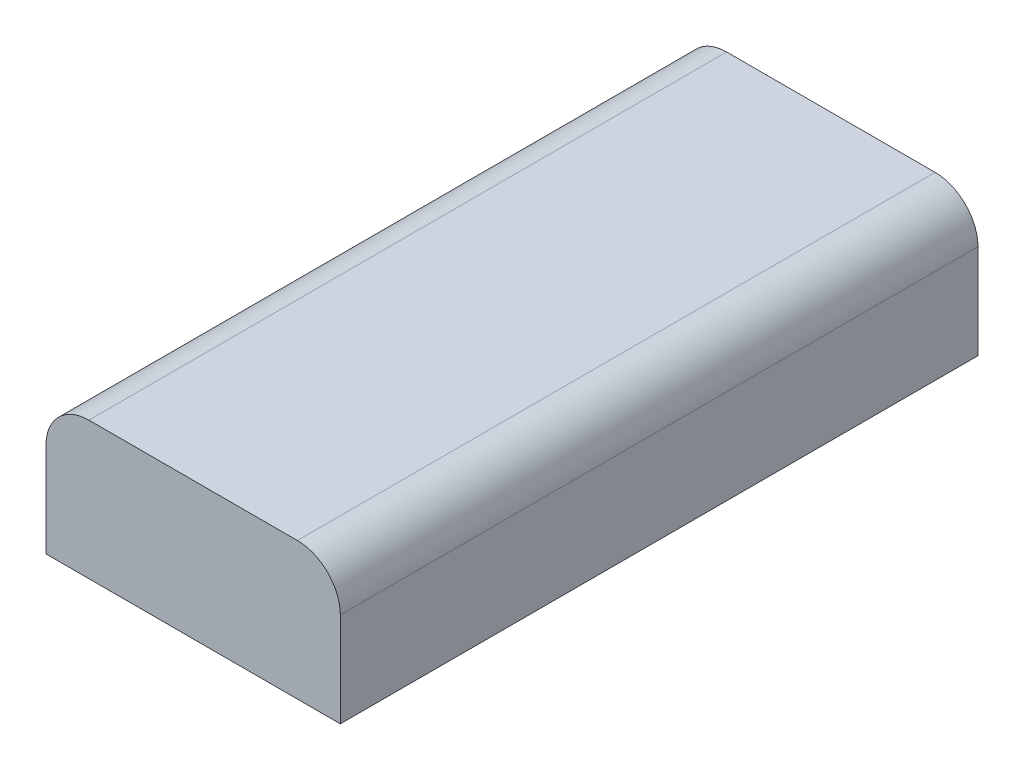
ISO-10303-21;
HEADER;
FILE_DESCRIPTION(('STEP AP214'),'2;1');
FILE_NAME('part.step','',(''),(''),'','','');
FILE_SCHEMA(('AUTOMOTIVE_DESIGN { 1 0 10303 214 1 1 1 1 }'));
ENDSEC;
DATA;
#1=APPLICATION_CONTEXT('core data for automotive mechanical design processes');
#2=APPLICATION_PROTOCOL_DEFINITION('international standard','automotive_design',2000,#1);
#3=PRODUCT_CONTEXT('',#1,'mechanical');
#4=PRODUCT('Part','Part','',(#3));
#5=PRODUCT_RELATED_PRODUCT_CATEGORY('part','',(#4));
#6=PRODUCT_DEFINITION_FORMATION('','',#4);
#7=PRODUCT_DEFINITION_CONTEXT('part definition',#1,'design');
#8=PRODUCT_DEFINITION('design','',#6,#7);
#9=PRODUCT_DEFINITION_SHAPE('','',#8);
#10=(LENGTH_UNIT() NAMED_UNIT(*) SI_UNIT(.MILLI.,.METRE.));
#11=(NAMED_UNIT(*) PLANE_ANGLE_UNIT() SI_UNIT($,.RADIAN.));
#12=(NAMED_UNIT(*) SI_UNIT($,.STERADIAN.) SOLID_ANGLE_UNIT());
#13=UNCERTAINTY_MEASURE_WITH_UNIT(LENGTH_MEASURE(1.E-05),#10,'distance_accuracy_value','');
#14=(GEOMETRIC_REPRESENTATION_CONTEXT(3) GLOBAL_UNCERTAINTY_ASSIGNED_CONTEXT((#13)) GLOBAL_UNIT_ASSIGNED_CONTEXT((#10,
#11,#12)) REPRESENTATION_CONTEXT('',''));
#15=CARTESIAN_POINT('',(0.,0.,0.));
#16=DIRECTION('',(0.,0.,1.));
#17=DIRECTION('',(1.,0.,0.));
#18=AXIS2_PLACEMENT_3D('',#15,#16,#17);
#19=CARTESIAN_POINT('',(0.,7.7,52.));
#20=DIRECTION('',(1.,0.,0.));
#21=DIRECTION('',(0.,0.,-1.));
#22=AXIS2_PLACEMENT_3D('',#19,#20,#21);
#23=PLANE('',#22);
#24=DIRECTION('',(0.,-1.,0.));
#25=VECTOR('',#24,1.);
#26=CARTESIAN_POINT('',(0.,7.7,0.));
#27=LINE('',#26,#25);
#28=CARTESIAN_POINT('',(0.,7.7,0.));
#29=VERTEX_POINT('',#28);
#30=CARTESIAN_POINT('',(0.,0.,0.));
#31=VERTEX_POINT('',#30);
#32=EDGE_CURVE('E131',#29,#31,#27,.T.);
#33=ORIENTED_EDGE('',*,*,#32,.T.);
#34=DIRECTION('',(0.,0.,-1.));
#35=VECTOR('',#34,1.);
#36=CARTESIAN_POINT('',(0.,0.,52.));
#37=LINE('',#36,#35);
#38=CARTESIAN_POINT('',(0.,0.,52.));
#39=VERTEX_POINT('',#38);
#40=EDGE_CURVE('E11',#39,#31,#37,.T.);
#41=ORIENTED_EDGE('',*,*,#40,.F.);
#42=DIRECTION('',(0.,-1.,0.));
#43=VECTOR('',#42,1.);
#44=CARTESIAN_POINT('',(0.,7.7,52.));
#45=LINE('',#44,#43);
#46=CARTESIAN_POINT('',(0.,7.7,52.));
#47=VERTEX_POINT('',#46);
#48=EDGE_CURVE('E147',#47,#39,#45,.T.);
#49=ORIENTED_EDGE('',*,*,#48,.F.);
#50=DIRECTION('',(0.,0.,-1.));
#51=VECTOR('',#50,1.);
#52=CARTESIAN_POINT('',(0.,7.7,52.));
#53=LINE('',#52,#51);
#54=EDGE_CURVE('E127',#47,#29,#53,.T.);
#55=ORIENTED_EDGE('',*,*,#54,.T.);
#56=EDGE_LOOP('',(#33,#41,#49,#55));
#57=FACE_BOUND('',#56,.T.);
#58=ADVANCED_FACE('F42',(#57),#23,.F.);
#59=CARTESIAN_POINT('',(0.,0.,52.));
#60=DIRECTION('',(0.,1.,0.));
#61=DIRECTION('',(0.,0.,1.));
#62=AXIS2_PLACEMENT_3D('',#59,#60,#61);
#63=PLANE('',#62);
#64=DIRECTION('',(1.,0.,0.));
#65=VECTOR('',#64,1.);
#66=CARTESIAN_POINT('',(0.,0.,0.));
#67=LINE('',#66,#65);
#68=CARTESIAN_POINT('',(24.,0.,0.));
#69=VERTEX_POINT('',#68);
#70=EDGE_CURVE('E135',#31,#69,#67,.T.);
#71=ORIENTED_EDGE('',*,*,#70,.T.);
#72=DIRECTION('',(0.,0.,-1.));
#73=VECTOR('',#72,1.);
#74=CARTESIAN_POINT('',(24.,0.,52.));
#75=LINE('',#74,#73);
#76=CARTESIAN_POINT('',(24.,0.,52.));
#77=VERTEX_POINT('',#76);
#78=EDGE_CURVE('E51',#77,#69,#75,.T.);
#79=ORIENTED_EDGE('',*,*,#78,.F.);
#80=DIRECTION('',(1.,0.,0.));
#81=VECTOR('',#80,1.);
#82=CARTESIAN_POINT('',(0.,0.,52.));
#83=LINE('',#82,#81);
#84=EDGE_CURVE('E96',#39,#77,#83,.T.);
#85=ORIENTED_EDGE('',*,*,#84,.F.);
#86=ORIENTED_EDGE('',*,*,#40,.T.);
#87=EDGE_LOOP('',(#71,#79,#85,#86));
#88=FACE_BOUND('',#87,.T.);
#89=ADVANCED_FACE('F175',(#88),#63,.F.);
#90=CARTESIAN_POINT('',(24.,0.,52.));
#91=DIRECTION('',(-1.,0.,0.));
#92=DIRECTION('',(0.,0.,1.));
#93=AXIS2_PLACEMENT_3D('',#90,#91,#92);
#94=PLANE('',#93);
#95=DIRECTION('',(0.,1.,0.));
#96=VECTOR('',#95,1.);
#97=CARTESIAN_POINT('',(24.,0.,0.));
#98=LINE('',#97,#96);
#99=CARTESIAN_POINT('',(24.,7.7,0.));
#100=VERTEX_POINT('',#99);
#101=EDGE_CURVE('E138',#69,#100,#98,.T.);
#102=ORIENTED_EDGE('',*,*,#101,.T.);
#103=DIRECTION('',(0.,0.,-1.));
#104=VECTOR('',#103,1.);
#105=CARTESIAN_POINT('',(24.,7.7,52.));
#106=LINE('',#105,#104);
#107=CARTESIAN_POINT('',(24.,7.7,52.));
#108=VERTEX_POINT('',#107);
#109=EDGE_CURVE('E120',#108,#100,#106,.T.);
#110=ORIENTED_EDGE('',*,*,#109,.F.);
#111=DIRECTION('',(0.,1.,0.));
#112=VECTOR('',#111,1.);
#113=CARTESIAN_POINT('',(24.,0.,52.));
#114=LINE('',#113,#112);
#115=EDGE_CURVE('E109',#77,#108,#114,.T.);
#116=ORIENTED_EDGE('',*,*,#115,.F.);
#117=ORIENTED_EDGE('',*,*,#78,.T.);
#118=EDGE_LOOP('',(#102,#110,#116,#117));
#119=FACE_BOUND('',#118,.T.);
#120=ADVANCED_FACE('F157',(#119),#94,.F.);
#121=CARTESIAN_POINT('',(20.5,7.7,52.));
#122=DIRECTION('',(0.,0.,-1.));
#123=DIRECTION('',(-1.,0.,0.));
#124=AXIS2_PLACEMENT_3D('',#121,#122,#123);
#125=CYLINDRICAL_SURFACE('',#124,3.5);
#126=CARTESIAN_POINT('',(20.5,7.7,0.));
#127=DIRECTION('',(0.,0.,1.));
#128=DIRECTION('',(1.,0.,0.));
#129=AXIS2_PLACEMENT_3D('',#126,#127,#128);
#130=CIRCLE('',#129,3.5);
#131=CARTESIAN_POINT('',(20.5,11.2,0.));
#132=VERTEX_POINT('',#131);
#133=EDGE_CURVE('E118',#100,#132,#130,.T.);
#134=ORIENTED_EDGE('',*,*,#133,.T.);
#135=DIRECTION('',(0.,0.,-1.));
#136=VECTOR('',#135,1.);
#137=CARTESIAN_POINT('',(20.5,11.2,52.));
#138=LINE('',#137,#136);
#139=CARTESIAN_POINT('',(20.5,11.2,52.));
#140=VERTEX_POINT('',#139);
#141=EDGE_CURVE('E115',#140,#132,#138,.T.);
#142=ORIENTED_EDGE('',*,*,#141,.F.);
#143=CARTESIAN_POINT('',(20.5,7.7,52.));
#144=DIRECTION('',(0.,0.,1.));
#145=DIRECTION('',(1.,0.,0.));
#146=AXIS2_PLACEMENT_3D('',#143,#144,#145);
#147=CIRCLE('',#146,3.5);
#148=EDGE_CURVE('E103',#108,#140,#147,.T.);
#149=ORIENTED_EDGE('',*,*,#148,.F.);
#150=ORIENTED_EDGE('',*,*,#109,.T.);
#151=EDGE_LOOP('',(#134,#142,#149,#150));
#152=FACE_BOUND('',#151,.T.);
#153=ADVANCED_FACE('F116',(#152),#125,.T.);
#154=CARTESIAN_POINT('',(20.5,11.2,52.));
#155=DIRECTION('',(0.,-1.,0.));
#156=DIRECTION('',(0.,0.,-1.));
#157=AXIS2_PLACEMENT_3D('',#154,#155,#156);
#158=PLANE('',#157);
#159=DIRECTION('',(-1.,0.,0.));
#160=VECTOR('',#159,1.);
#161=CARTESIAN_POINT('',(20.5,11.2,0.));
#162=LINE('',#161,#160);
#163=CARTESIAN_POINT('',(3.5,11.2,0.));
#164=VERTEX_POINT('',#163);
#165=EDGE_CURVE('E82',#132,#164,#162,.T.);
#166=ORIENTED_EDGE('',*,*,#165,.T.);
#167=DIRECTION('',(0.,0.,-1.));
#168=VECTOR('',#167,1.);
#169=CARTESIAN_POINT('',(3.5,11.2,52.));
#170=LINE('',#169,#168);
#171=CARTESIAN_POINT('',(3.5,11.2,52.));
#172=VERTEX_POINT('',#171);
#173=EDGE_CURVE('E121',#172,#164,#170,.T.);
#174=ORIENTED_EDGE('',*,*,#173,.F.);
#175=DIRECTION('',(-1.,0.,0.));
#176=VECTOR('',#175,1.);
#177=CARTESIAN_POINT('',(20.5,11.2,52.));
#178=LINE('',#177,#176);
#179=EDGE_CURVE('E107',#140,#172,#178,.T.);
#180=ORIENTED_EDGE('',*,*,#179,.F.);
#181=ORIENTED_EDGE('',*,*,#141,.T.);
#182=EDGE_LOOP('',(#166,#174,#180,#181));
#183=FACE_BOUND('',#182,.T.);
#184=ADVANCED_FACE('F123',(#183),#158,.F.);
#185=CARTESIAN_POINT('',(3.5,7.7,52.));
#186=DIRECTION('',(0.,0.,-1.));
#187=DIRECTION('',(-1.,0.,0.));
#188=AXIS2_PLACEMENT_3D('',#185,#186,#187);
#189=CYLINDRICAL_SURFACE('',#188,3.5);
#190=CARTESIAN_POINT('',(3.5,7.7,0.));
#191=DIRECTION('',(0.,0.,1.));
#192=DIRECTION('',(1.,0.,0.));
#193=AXIS2_PLACEMENT_3D('',#190,#191,#192);
#194=CIRCLE('',#193,3.5);
#195=EDGE_CURVE('E88',#164,#29,#194,.T.);
#196=ORIENTED_EDGE('',*,*,#195,.T.);
#197=ORIENTED_EDGE('',*,*,#54,.F.);
#198=CARTESIAN_POINT('',(3.5,7.7,52.));
#199=DIRECTION('',(0.,0.,1.));
#200=DIRECTION('',(1.,0.,0.));
#201=AXIS2_PLACEMENT_3D('',#198,#199,#200);
#202=CIRCLE('',#201,3.5);
#203=EDGE_CURVE('E59',#172,#47,#202,.T.);
#204=ORIENTED_EDGE('',*,*,#203,.F.);
#205=ORIENTED_EDGE('',*,*,#173,.T.);
#206=EDGE_LOOP('',(#196,#197,#204,#205));
#207=FACE_BOUND('',#206,.T.);
#208=ADVANCED_FACE('F164',(#207),#189,.T.);
#209=CARTESIAN_POINT('',(20.5,7.7,52.));
#210=DIRECTION('',(0.,0.,1.));
#211=DIRECTION('',(1.,0.,0.));
#212=AXIS2_PLACEMENT_3D('',#209,#210,#211);
#213=PLANE('',#212);
#214=ORIENTED_EDGE('',*,*,#48,.T.);
#215=ORIENTED_EDGE('',*,*,#84,.T.);
#216=ORIENTED_EDGE('',*,*,#115,.T.);
#217=ORIENTED_EDGE('',*,*,#148,.T.);
#218=ORIENTED_EDGE('',*,*,#179,.T.);
#219=ORIENTED_EDGE('',*,*,#203,.T.);
#220=EDGE_LOOP('',(#214,#215,#216,#217,#218,#219));
#221=FACE_BOUND('',#220,.T.);
#222=ADVANCED_FACE('F105',(#221),#213,.T.);
#223=CARTESIAN_POINT('',(20.5,7.7,0.));
#224=DIRECTION('',(0.,0.,1.));
#225=DIRECTION('',(1.,0.,0.));
#226=AXIS2_PLACEMENT_3D('',#223,#224,#225);
#227=PLANE('',#226);
#228=ORIENTED_EDGE('',*,*,#32,.F.);
#229=ORIENTED_EDGE('',*,*,#195,.F.);
#230=ORIENTED_EDGE('',*,*,#165,.F.);
#231=ORIENTED_EDGE('',*,*,#133,.F.);
#232=ORIENTED_EDGE('',*,*,#101,.F.);
#233=ORIENTED_EDGE('',*,*,#70,.F.);
#234=EDGE_LOOP('',(#228,#229,#230,#231,#232,#233));
#235=FACE_BOUND('',#234,.T.);
#236=ADVANCED_FACE('F160',(#235),#227,.F.);
#237=CLOSED_SHELL('',(#58,#89,#120,#153,#184,#208,#222,#236));
#238=MANIFOLD_SOLID_BREP('B2',#237);
#239=ADVANCED_BREP_SHAPE_REPRESENTATION('',(#18,#238),#14);
#240=SHAPE_DEFINITION_REPRESENTATION(#9,#239);
ENDSEC;
END-ISO-10303-21;
